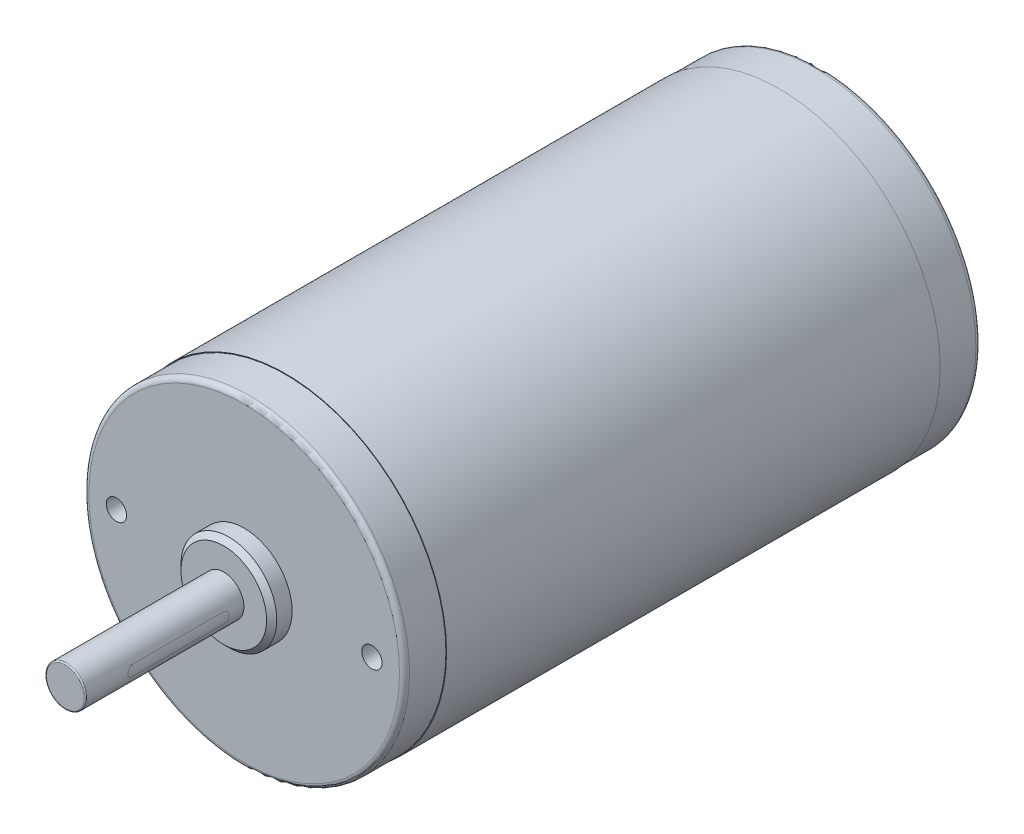
ISO-10303-21;
HEADER;
FILE_DESCRIPTION(('STEP AP214'),'2;1');
FILE_NAME('part.step','',(''),(''),'','','');
FILE_SCHEMA(('AUTOMOTIVE_DESIGN { 1 0 10303 214 1 1 1 1 }'));
ENDSEC;
DATA;
#1=APPLICATION_CONTEXT('core data for automotive mechanical design processes');
#2=APPLICATION_PROTOCOL_DEFINITION('international standard','automotive_design',2000,#1);
#3=PRODUCT_CONTEXT('',#1,'mechanical');
#4=PRODUCT('Part','Part','',(#3));
#5=PRODUCT_RELATED_PRODUCT_CATEGORY('part','',(#4));
#6=PRODUCT_DEFINITION_FORMATION('','',#4);
#7=PRODUCT_DEFINITION_CONTEXT('part definition',#1,'design');
#8=PRODUCT_DEFINITION('design','',#6,#7);
#9=PRODUCT_DEFINITION_SHAPE('','',#8);
#10=(LENGTH_UNIT() NAMED_UNIT(*) SI_UNIT(.MILLI.,.METRE.));
#11=(NAMED_UNIT(*) PLANE_ANGLE_UNIT() SI_UNIT($,.RADIAN.));
#12=(NAMED_UNIT(*) SI_UNIT($,.STERADIAN.) SOLID_ANGLE_UNIT());
#13=UNCERTAINTY_MEASURE_WITH_UNIT(LENGTH_MEASURE(1.E-05),#10,'distance_accuracy_value','');
#14=(GEOMETRIC_REPRESENTATION_CONTEXT(3) GLOBAL_UNCERTAINTY_ASSIGNED_CONTEXT((#13)) GLOBAL_UNIT_ASSIGNED_CONTEXT((#10,
#11,#12)) REPRESENTATION_CONTEXT('',''));
#15=CARTESIAN_POINT('',(0.,0.,0.));
#16=DIRECTION('',(0.,0.,1.));
#17=DIRECTION('',(1.,0.,0.));
#18=AXIS2_PLACEMENT_3D('',#15,#16,#17);
#19=CARTESIAN_POINT('',(35.56,109.2962,10.8204000000007));
#20=DIRECTION('',(0.,0.,-1.));
#21=DIRECTION('',(-1.,0.,0.));
#22=AXIS2_PLACEMENT_3D('',#19,#20,#21);
#23=CYLINDRICAL_SURFACE('',#22,32.0040000000005);
#24=CARTESIAN_POINT('',(35.56,109.2962,10.8204000000007));
#25=DIRECTION('',(0.,0.,-1.));
#26=DIRECTION('',(-1.,0.,0.));
#27=AXIS2_PLACEMENT_3D('',#24,#25,#26);
#28=CIRCLE('',#27,32.0040000000005);
#29=CARTESIAN_POINT('',(3.5559999999995,109.2962,10.8204000000007));
#30=VERTEX_POINT('',#29);
#31=EDGE_CURVE('P0_E177',#30,#30,#28,.T.);
#32=ORIENTED_EDGE('',*,*,#31,.T.);
#33=EDGE_LOOP('',(#32));
#34=FACE_BOUND('',#33,.T.);
#35=CARTESIAN_POINT('',(35.56,109.2962,-87.325199999998));
#36=DIRECTION('',(0.,0.,-1.));
#37=DIRECTION('',(-1.,0.,0.));
#38=AXIS2_PLACEMENT_3D('',#35,#36,#37);
#39=CIRCLE('',#38,32.0040000000005);
#40=CARTESIAN_POINT('',(3.5559999999995,109.2962,-87.325199999998));
#41=VERTEX_POINT('',#40);
#42=EDGE_CURVE('P0_E119',#41,#41,#39,.T.);
#43=ORIENTED_EDGE('',*,*,#42,.F.);
#44=EDGE_LOOP('',(#43));
#45=FACE_BOUND('',#44,.T.);
#46=ADVANCED_FACE('P0_F36',(#34,#45),#23,.T.);
#47=CARTESIAN_POINT('',(67.5640000000005,109.2962,10.8204000000007));
#48=DIRECTION('',(0.,0.,1.));
#49=DIRECTION('',(1.,0.,0.));
#50=AXIS2_PLACEMENT_3D('',#47,#48,#49);
#51=PLANE('',#50);
#52=CARTESIAN_POINT('',(35.56,109.2962,10.8204000000007));
#53=DIRECTION('',(0.,0.,1.));
#54=DIRECTION('',(1.,0.,0.));
#55=AXIS2_PLACEMENT_3D('',#52,#53,#54);
#56=CIRCLE('',#55,31.8770000000005);
#57=CARTESIAN_POINT('',(67.4370000000005,109.2962,10.8204000000007));
#58=VERTEX_POINT('',#57);
#59=EDGE_CURVE('P0_E168',#58,#58,#56,.T.);
#60=ORIENTED_EDGE('',*,*,#59,.F.);
#61=EDGE_LOOP('',(#60));
#62=FACE_BOUND('',#61,.T.);
#63=ORIENTED_EDGE('',*,*,#31,.F.);
#64=EDGE_LOOP('',(#63));
#65=FACE_BOUND('',#64,.T.);
#66=ADVANCED_FACE('P0_F225',(#62,#65),#51,.T.);
#67=CARTESIAN_POINT('',(35.56,109.2962,-87.325199999998));
#68=DIRECTION('',(0.,0.,-1.));
#69=DIRECTION('',(-1.,0.,0.));
#70=AXIS2_PLACEMENT_3D('',#67,#68,#69);
#71=PLANE('',#70);
#72=CARTESIAN_POINT('',(35.56,109.2962,-87.325199999998));
#73=DIRECTION('',(0.,0.,-1.));
#74=DIRECTION('',(-1.,0.,0.));
#75=AXIS2_PLACEMENT_3D('',#72,#73,#74);
#76=CIRCLE('',#75,31.8770000000005);
#77=CARTESIAN_POINT('',(3.68299999999951,109.2962,-87.325199999998));
#78=VERTEX_POINT('',#77);
#79=EDGE_CURVE('P0_E174',#78,#78,#76,.T.);
#80=ORIENTED_EDGE('',*,*,#79,.F.);
#81=EDGE_LOOP('',(#80));
#82=FACE_BOUND('',#81,.T.);
#83=ORIENTED_EDGE('',*,*,#42,.T.);
#84=EDGE_LOOP('',(#83));
#85=FACE_BOUND('',#84,.T.);
#86=ADVANCED_FACE('P0_F231',(#82,#85),#71,.T.);
#87=CARTESIAN_POINT('',(35.56,109.2962,-95.554799999998));
#88=DIRECTION('',(0.,0.,1.));
#89=DIRECTION('',(1.,0.,0.));
#90=AXIS2_PLACEMENT_3D('',#87,#88,#89);
#91=CYLINDRICAL_SURFACE('',#90,31.8770000000005);
#92=CARTESIAN_POINT('',(35.56,109.2962,-94.554799999998));
#93=DIRECTION('',(0.,0.,-1.));
#94=DIRECTION('',(-1.,0.,0.));
#95=AXIS2_PLACEMENT_3D('',#92,#93,#94);
#96=CIRCLE('',#95,31.8770000000005);
#97=CARTESIAN_POINT('',(3.68299999999951,109.2962,-94.554799999998));
#98=VERTEX_POINT('',#97);
#99=EDGE_CURVE('P0_E208',#98,#98,#96,.F.);
#100=ORIENTED_EDGE('',*,*,#99,.T.);
#101=EDGE_LOOP('',(#100));
#102=FACE_BOUND('',#101,.T.);
#103=ORIENTED_EDGE('',*,*,#79,.T.);
#104=EDGE_LOOP('',(#103));
#105=FACE_BOUND('',#104,.T.);
#106=ADVANCED_FACE('P0_F289',(#102,#105),#91,.T.);
#107=CARTESIAN_POINT('',(35.56,109.2962,-95.554799999998));
#108=DIRECTION('',(0.,0.,-1.));
#109=DIRECTION('',(-1.,0.,0.));
#110=AXIS2_PLACEMENT_3D('',#107,#108,#109);
#111=PLANE('',#110);
#112=CARTESIAN_POINT('',(35.56,109.2962,-95.554799999998));
#113=DIRECTION('',(0.,0.,-1.));
#114=DIRECTION('',(-1.,0.,0.));
#115=AXIS2_PLACEMENT_3D('',#112,#113,#114);
#116=CIRCLE('',#115,30.8770000000005);
#117=CARTESIAN_POINT('',(4.6829999999995,109.2962,-95.554799999998));
#118=VERTEX_POINT('',#117);
#119=EDGE_CURVE('P0_E205',#118,#118,#116,.T.);
#120=ORIENTED_EDGE('',*,*,#119,.T.);
#121=EDGE_LOOP('',(#120));
#122=FACE_BOUND('',#121,.T.);
#123=CARTESIAN_POINT('',(46.76735963712,127.903290682857,-95.554799999998));
#124=DIRECTION('',(0.,0.,-1.));
#125=DIRECTION('',(-1.,0.,0.));
#126=AXIS2_PLACEMENT_3D('',#123,#124,#125);
#127=CIRCLE('',#126,4.31800000197918);
#128=CARTESIAN_POINT('',(42.4493596351408,127.903290682857,-95.554799999998));
#129=VERTEX_POINT('',#128);
#130=EDGE_CURVE('P0_E184',#129,#129,#127,.T.);
#131=ORIENTED_EDGE('',*,*,#130,.F.);
#132=EDGE_LOOP('',(#131));
#133=FACE_BOUND('',#132,.T.);
#134=CARTESIAN_POINT('',(54.1670906808811,120.503559639095,-95.554799999998));
#135=DIRECTION('',(0.,0.,-1.));
#136=DIRECTION('',(-1.,0.,0.));
#137=AXIS2_PLACEMENT_3D('',#134,#135,#136);
#138=CIRCLE('',#137,4.3180000019652);
#139=CARTESIAN_POINT('',(49.8490906789159,120.503559639095,-95.554799999998));
#140=VERTEX_POINT('',#139);
#141=EDGE_CURVE('P0_E164',#140,#140,#138,.T.);
#142=ORIENTED_EDGE('',*,*,#141,.F.);
#143=EDGE_LOOP('',(#142));
#144=FACE_BOUND('',#143,.T.);
#145=CARTESIAN_POINT('',(35.56,109.2962,-95.554799999998));
#146=DIRECTION('',(0.,0.,-1.));
#147=DIRECTION('',(-1.,0.,0.));
#148=AXIS2_PLACEMENT_3D('',#145,#146,#147);
#149=CIRCLE('',#148,15.0368000000003);
#150=CARTESIAN_POINT('',(20.5231999999997,109.2962,-95.554799999998));
#151=VERTEX_POINT('',#150);
#152=EDGE_CURVE('P0_E171',#151,#151,#149,.T.);
#153=ORIENTED_EDGE('',*,*,#152,.F.);
#154=EDGE_LOOP('',(#153));
#155=FACE_BOUND('',#154,.T.);
#156=ADVANCED_FACE('P0_F285',(#122,#133,#144,#155),#111,.T.);
#157=CARTESIAN_POINT('',(35.56,109.2962,-100.317299999998));
#158=DIRECTION('',(0.,0.,1.));
#159=DIRECTION('',(1.,0.,0.));
#160=AXIS2_PLACEMENT_3D('',#157,#158,#159);
#161=CYLINDRICAL_SURFACE('',#160,15.0368000000003);
#162=CARTESIAN_POINT('',(35.56,109.2962,-99.317299999998));
#163=DIRECTION('',(0.,0.,-1.));
#164=DIRECTION('',(-1.,0.,0.));
#165=AXIS2_PLACEMENT_3D('',#162,#163,#164);
#166=CIRCLE('',#165,15.0368000000003);
#167=CARTESIAN_POINT('',(20.5231999999997,109.2962,-99.317299999998));
#168=VERTEX_POINT('',#167);
#169=EDGE_CURVE('P0_E11',#168,#168,#166,.F.);
#170=ORIENTED_EDGE('',*,*,#169,.T.);
#171=EDGE_LOOP('',(#170));
#172=FACE_BOUND('',#171,.T.);
#173=ORIENTED_EDGE('',*,*,#152,.T.);
#174=EDGE_LOOP('',(#173));
#175=FACE_BOUND('',#174,.T.);
#176=ADVANCED_FACE('P0_F282',(#172,#175),#161,.T.);
#177=CARTESIAN_POINT('',(35.56,109.2962,-100.317299999998));
#178=DIRECTION('',(0.,0.,-1.));
#179=DIRECTION('',(-1.,0.,0.));
#180=AXIS2_PLACEMENT_3D('',#177,#178,#179);
#181=PLANE('',#180);
#182=CARTESIAN_POINT('',(35.56,109.2962,-100.317299999998));
#183=DIRECTION('',(0.,0.,-1.));
#184=DIRECTION('',(-1.,0.,0.));
#185=AXIS2_PLACEMENT_3D('',#182,#183,#184);
#186=CIRCLE('',#185,14.0368000000003);
#187=CARTESIAN_POINT('',(21.5231999999997,109.2962,-100.317299999998));
#188=VERTEX_POINT('',#187);
#189=EDGE_CURVE('P0_E44',#188,#188,#186,.T.);
#190=ORIENTED_EDGE('',*,*,#189,.T.);
#191=EDGE_LOOP('',(#190));
#192=FACE_BOUND('',#191,.T.);
#193=ADVANCED_FACE('P0_F213',(#192),#181,.T.);
#194=CARTESIAN_POINT('',(35.56,109.2962,19.05));
#195=DIRECTION('',(0.,0.,-1.));
#196=DIRECTION('',(-1.,0.,0.));
#197=AXIS2_PLACEMENT_3D('',#194,#195,#196);
#198=CYLINDRICAL_SURFACE('',#197,31.8770000000005);
#199=CARTESIAN_POINT('',(35.56,109.2962,18.05));
#200=DIRECTION('',(0.,0.,1.));
#201=DIRECTION('',(1.,0.,0.));
#202=AXIS2_PLACEMENT_3D('',#199,#200,#201);
#203=CIRCLE('',#202,31.8770000000005);
#204=CARTESIAN_POINT('',(67.4370000000005,109.2962,18.05));
#205=VERTEX_POINT('',#204);
#206=EDGE_CURVE('P0_E202',#205,#205,#203,.F.);
#207=ORIENTED_EDGE('',*,*,#206,.T.);
#208=EDGE_LOOP('',(#207));
#209=FACE_BOUND('',#208,.T.);
#210=ORIENTED_EDGE('',*,*,#59,.T.);
#211=EDGE_LOOP('',(#210));
#212=FACE_BOUND('',#211,.T.);
#213=ADVANCED_FACE('P0_F257',(#209,#212),#198,.T.);
#214=CARTESIAN_POINT('',(35.56,109.2962,19.05));
#215=DIRECTION('',(0.,0.,1.));
#216=DIRECTION('',(1.,0.,0.));
#217=AXIS2_PLACEMENT_3D('',#214,#215,#216);
#218=PLANE('',#217);
#219=CARTESIAN_POINT('',(35.56,109.2962,19.05));
#220=DIRECTION('',(0.,0.,1.));
#221=DIRECTION('',(1.,0.,0.));
#222=AXIS2_PLACEMENT_3D('',#219,#220,#221);
#223=CIRCLE('',#222,30.8770000000005);
#224=CARTESIAN_POINT('',(66.4370000000005,109.2962,19.05));
#225=VERTEX_POINT('',#224);
#226=EDGE_CURVE('P0_E199',#225,#225,#223,.T.);
#227=ORIENTED_EDGE('',*,*,#226,.T.);
#228=EDGE_LOOP('',(#227));
#229=FACE_BOUND('',#228,.T.);
#230=CARTESIAN_POINT('',(10.1599999999994,109.2962,19.05));
#231=DIRECTION('',(0.,0.,1.));
#232=DIRECTION('',(1.,0.,0.));
#233=AXIS2_PLACEMENT_3D('',#230,#231,#232);
#234=CIRCLE('',#233,2.01930000000002);
#235=CARTESIAN_POINT('',(12.1792999999994,109.2962,19.05));
#236=VERTEX_POINT('',#235);
#237=EDGE_CURVE('P0_E93',#236,#236,#234,.T.);
#238=ORIENTED_EDGE('',*,*,#237,.F.);
#239=EDGE_LOOP('',(#238));
#240=FACE_BOUND('',#239,.T.);
#241=CARTESIAN_POINT('',(60.96,109.2962,19.05));
#242=DIRECTION('',(0.,0.,1.));
#243=DIRECTION('',(1.,0.,0.));
#244=AXIS2_PLACEMENT_3D('',#241,#242,#243);
#245=CIRCLE('',#244,2.01930000000002);
#246=CARTESIAN_POINT('',(62.9793,109.2962,19.05));
#247=VERTEX_POINT('',#246);
#248=EDGE_CURVE('P0_E92',#247,#247,#245,.T.);
#249=ORIENTED_EDGE('',*,*,#248,.F.);
#250=EDGE_LOOP('',(#249));
#251=FACE_BOUND('',#250,.T.);
#252=CARTESIAN_POINT('',(35.56,109.2962,19.05));
#253=DIRECTION('',(0.,0.,1.));
#254=DIRECTION('',(1.,0.,0.));
#255=AXIS2_PLACEMENT_3D('',#252,#253,#254);
#256=CIRCLE('',#255,9.52500000000019);
#257=CARTESIAN_POINT('',(45.0850000000002,109.2962,19.05));
#258=VERTEX_POINT('',#257);
#259=EDGE_CURVE('P0_E165',#258,#258,#256,.T.);
#260=ORIENTED_EDGE('',*,*,#259,.F.);
#261=EDGE_LOOP('',(#260));
#262=FACE_BOUND('',#261,.T.);
#263=ADVANCED_FACE('P0_F253',(#229,#240,#251,#262),#218,.T.);
#264=CARTESIAN_POINT('',(35.56,109.2962,23.114));
#265=DIRECTION('',(0.,0.,-1.));
#266=DIRECTION('',(-1.,0.,0.));
#267=AXIS2_PLACEMENT_3D('',#264,#265,#266);
#268=CYLINDRICAL_SURFACE('',#267,9.52500000000019);
#269=CARTESIAN_POINT('',(35.56,109.2962,22.0980000018232));
#270=DIRECTION('',(0.,0.,1.));
#271=DIRECTION('',(1.,0.,0.));
#272=AXIS2_PLACEMENT_3D('',#269,#270,#271);
#273=CIRCLE('',#272,9.52500000000019);
#274=CARTESIAN_POINT('',(45.0850000000002,109.2962,22.0980000018232));
#275=VERTEX_POINT('',#274);
#276=EDGE_CURVE('P0_E190',#275,#275,#273,.F.);
#277=ORIENTED_EDGE('',*,*,#276,.T.);
#278=EDGE_LOOP('',(#277));
#279=FACE_BOUND('',#278,.T.);
#280=ORIENTED_EDGE('',*,*,#259,.T.);
#281=EDGE_LOOP('',(#280));
#282=FACE_BOUND('',#281,.T.);
#283=ADVANCED_FACE('P0_F256',(#279,#282),#268,.T.);
#284=CARTESIAN_POINT('',(35.56,109.2962,23.114));
#285=DIRECTION('',(0.,0.,1.));
#286=DIRECTION('',(1.,0.,0.));
#287=AXIS2_PLACEMENT_3D('',#284,#285,#286);
#288=PLANE('',#287);
#289=CARTESIAN_POINT('',(35.56,109.2962,23.114));
#290=DIRECTION('',(0.,0.,1.));
#291=DIRECTION('',(1.,0.,0.));
#292=AXIS2_PLACEMENT_3D('',#289,#290,#291);
#293=CIRCLE('',#292,8.50899999999979);
#294=CARTESIAN_POINT('',(44.0689999999998,109.2962,23.114));
#295=VERTEX_POINT('',#294);
#296=EDGE_CURVE('P0_E187',#295,#295,#293,.T.);
#297=ORIENTED_EDGE('',*,*,#296,.T.);
#298=EDGE_LOOP('',(#297));
#299=FACE_BOUND('',#298,.T.);
#300=CARTESIAN_POINT('',(35.56,109.2962,23.114));
#301=DIRECTION('',(0.,0.,1.));
#302=DIRECTION('',(1.,0.,0.));
#303=AXIS2_PLACEMENT_3D('',#300,#301,#302);
#304=CIRCLE('',#303,4.00000000000007);
#305=CARTESIAN_POINT('',(39.5600000000001,109.2962,23.114));
#306=VERTEX_POINT('',#305);
#307=EDGE_CURVE('P0_E161',#306,#306,#304,.T.);
#308=ORIENTED_EDGE('',*,*,#307,.F.);
#309=EDGE_LOOP('',(#308));
#310=FACE_BOUND('',#309,.T.);
#311=ADVANCED_FACE('P0_F266',(#299,#310),#288,.T.);
#312=CARTESIAN_POINT('',(35.56,109.2962,54.614));
#313=DIRECTION('',(0.,0.,-1.));
#314=DIRECTION('',(-1.,0.,0.));
#315=AXIS2_PLACEMENT_3D('',#312,#313,#314);
#316=CYLINDRICAL_SURFACE('',#315,4.00000000000007);
#317=CARTESIAN_POINT('',(35.56,109.2962,54.36));
#318=DIRECTION('',(0.,0.,1.));
#319=DIRECTION('',(1.,0.,0.));
#320=AXIS2_PLACEMENT_3D('',#317,#318,#319);
#321=CIRCLE('',#320,4.00000000000007);
#322=CARTESIAN_POINT('',(39.5600000000001,109.2962,54.36));
#323=VERTEX_POINT('',#322);
#324=EDGE_CURVE('P0_E196',#323,#323,#321,.F.);
#325=ORIENTED_EDGE('',*,*,#324,.T.);
#326=EDGE_LOOP('',(#325));
#327=FACE_BOUND('',#326,.T.);
#328=DIRECTION('',(0.,0.,-1.));
#329=VECTOR('',#328,1.);
#330=CARTESIAN_POINT('',(39.4197279696891,110.3462,54.614));
#331=LINE('',#330,#329);
#332=CARTESIAN_POINT('',(39.4197279696891,110.3462,45.1));
#333=VERTEX_POINT('',#332);
#334=CARTESIAN_POINT('',(39.4197279696891,110.3462,27.1));
#335=VERTEX_POINT('',#334);
#336=EDGE_CURVE('P0_E129',#333,#335,#331,.T.);
#337=ORIENTED_EDGE('',*,*,#336,.T.);
#338=CARTESIAN_POINT('',(39.4197279696891,110.3462,27.1));
#339=CARTESIAN_POINT('',(39.4197258950768,110.34620041025,27.0710051009623));
#340=CARTESIAN_POINT('',(39.4200551064329,110.344998227256,27.0420246228058));
#341=CARTESIAN_POINT('',(39.4213547123988,110.340206209835,26.9842814282389));
#342=CARTESIAN_POINT('',(39.4223249908093,110.336616808112,26.9555186733196));
#343=CARTESIAN_POINT('',(39.4261578920524,110.322321932764,26.8699951160553));
#344=CARTESIAN_POINT('',(39.4299428342912,110.308089542303,26.8138236492985));
#345=CARTESIAN_POINT('',(39.4395286889104,110.270686835054,26.7047742036821));
#346=CARTESIAN_POINT('',(39.445329326456,110.247517736714,26.6518957769836));
#347=CARTESIAN_POINT('',(39.4582892232805,110.192930496084,26.5507488556207));
#348=CARTESIAN_POINT('',(39.4654488628844,110.161510043656,26.5024816571346));
#349=CARTESIAN_POINT('',(39.4805119710478,110.090509636998,26.4107922298844));
#350=CARTESIAN_POINT('',(39.4884281885094,110.050767743087,26.3674975328551));
#351=CARTESIAN_POINT('',(39.5040047400555,109.964586854037,26.2880931254825));
#352=CARTESIAN_POINT('',(39.5116649818293,109.91814547434,26.2519859843525));
#353=CARTESIAN_POINT('',(39.526010604883,109.818987620195,26.1874496103786));
#354=CARTESIAN_POINT('',(39.5326785635433,109.766183168704,26.159151481312));
#355=CARTESIAN_POINT('',(39.5441298010583,109.656397945762,26.1119111599868));
#356=CARTESIAN_POINT('',(39.5489153447307,109.599422291421,26.0929577177131));
#357=CARTESIAN_POINT('',(39.5549473168842,109.501171577289,26.0693758272655));
#358=CARTESIAN_POINT('',(39.5568321627736,109.46054623456,26.0621227253234));
#359=CARTESIAN_POINT('',(39.5593590428507,109.378686103609,26.052433965248));
#360=CARTESIAN_POINT('',(39.560001100914,109.337451327111,26.0499982145665));
#361=CARTESIAN_POINT('',(39.5599984549201,109.238305738357,26.0500025057704));
#362=CARTESIAN_POINT('',(39.5587300938834,109.18037887734,26.0548061723029));
#363=CARTESIAN_POINT('',(39.5537908073877,109.066174828257,26.0738680806171));
#364=CARTESIAN_POINT('',(39.5501176251492,109.009899241695,26.0881352034471));
#365=CARTESIAN_POINT('',(39.5407752151886,108.900688958064,26.1256289904428));
#366=CARTESIAN_POINT('',(39.5351088856793,108.847749541003,26.148842650214));
#367=CARTESIAN_POINT('',(39.5223803452478,108.746519851806,26.2035277086069));
#368=CARTESIAN_POINT('',(39.5153181479083,108.698229534436,26.2349990268771));
#369=CARTESIAN_POINT('',(39.5003832391547,108.606575585264,26.3060552920619));
#370=CARTESIAN_POINT('',(39.4924970081334,108.563331555532,26.3457916691671));
#371=CARTESIAN_POINT('',(39.4768899553604,108.484036309153,26.431929982209));
#372=CARTESIAN_POINT('',(39.4691691622905,108.447986330864,26.4783330633665));
#373=CARTESIAN_POINT('',(39.4546281048764,108.383519395399,26.5774412854526));
#374=CARTESIAN_POINT('',(39.447825217303,108.355241372008,26.6302394851058));
#375=CARTESIAN_POINT('',(39.4360941322255,108.308025058775,26.7400354515098));
#376=CARTESIAN_POINT('',(39.4311644713835,108.289079475123,26.7970298984879));
#377=CARTESIAN_POINT('',(39.424947536189,108.265530062073,26.8952701656664));
#378=CARTESIAN_POINT('',(39.4230031721686,108.258293447667,26.9358624533813));
#379=CARTESIAN_POINT('',(39.4203876966156,108.248624950633,27.0176289590907));
#380=CARTESIAN_POINT('',(39.419715789786,108.246190066839,27.058802797386));
#381=CARTESIAN_POINT('',(39.4197279696891,108.2462,27.1));
#382=B_SPLINE_CURVE_WITH_KNOTS('',3,(#338,#339,#340,#341,#342,#343,#344,#345,#346,#347,#348,
#349,#350,#351,#352,#353,#354,#355,#356,#357,#358,#359,#360,#361,#362,#363,#364,#365,#366,#367,
#368,#369,#370,#371,#372,#373,#374,#375,#376,#377,#378,#379,#380,#381),.UNSPECIFIED.,.F.,.F.,(4,
2,2,2,2,2,2,2,2,2,2,2,2,2,2,2,2,2,2,2,2,4),(0.,0.0869295778834455,0.173843403286115,
0.347151826879623,0.520436629596136,0.693769998810197,0.870856390838592,1.0480059697082,
1.22797015523124,1.40771715061754,1.53136439682191,1.65500926755904,1.82853892099358,
2.00223165541559,2.17567286221396,2.34911238140168,2.52606492372391,2.7030478997598,
2.88301467869372,3.06284057971519,3.18638852057381,3.30985921734618),.UNSPECIFIED.);
#383=CARTESIAN_POINT('',(39.4197279696891,108.2462,27.1));
#384=VERTEX_POINT('',#383);
#385=EDGE_CURVE('P0_E115',#335,#384,#382,.T.);
#386=ORIENTED_EDGE('',*,*,#385,.T.);
#387=DIRECTION('',(0.,0.,-1.));
#388=VECTOR('',#387,1.);
#389=CARTESIAN_POINT('',(39.4197279696891,108.2462,54.614));
#390=LINE('',#389,#388);
#391=CARTESIAN_POINT('',(39.4197279696891,108.2462,45.1));
#392=VERTEX_POINT('',#391);
#393=EDGE_CURVE('P0_E142',#384,#392,#390,.F.);
#394=ORIENTED_EDGE('',*,*,#393,.T.);
#395=CARTESIAN_POINT('',(39.4197279696891,108.2462,45.1));
#396=CARTESIAN_POINT('',(39.4197258950768,108.24619958975,45.1289948990377));
#397=CARTESIAN_POINT('',(39.4200551064328,108.247401772744,45.1579753771942));
#398=CARTESIAN_POINT('',(39.4213547123988,108.252193790165,45.2157185717611));
#399=CARTESIAN_POINT('',(39.4223249908093,108.255783191888,45.2444813266804));
#400=CARTESIAN_POINT('',(39.4261578920524,108.270078067236,45.3300048839447));
#401=CARTESIAN_POINT('',(39.4299428342912,108.284310457697,45.3861763507014));
#402=CARTESIAN_POINT('',(39.4395286889104,108.321713164946,45.4952257963179));
#403=CARTESIAN_POINT('',(39.445329326456,108.344882263286,45.5481042230163));
#404=CARTESIAN_POINT('',(39.4582892232805,108.399469503916,45.6492511443793));
#405=CARTESIAN_POINT('',(39.4654488628844,108.430889956344,45.6975183428654));
#406=CARTESIAN_POINT('',(39.4805119710478,108.501890363002,45.7892077701155));
#407=CARTESIAN_POINT('',(39.4884281885094,108.541632256913,45.8325024671448));
#408=CARTESIAN_POINT('',(39.5040047400555,108.627813145963,45.9119068745175));
#409=CARTESIAN_POINT('',(39.5116649818293,108.67425452566,45.9480140156475));
#410=CARTESIAN_POINT('',(39.526010604883,108.773412379805,46.0125503896214));
#411=CARTESIAN_POINT('',(39.5326785635433,108.826216831296,46.040848518688));
#412=CARTESIAN_POINT('',(39.5441298010583,108.936002054238,46.0880888400132));
#413=CARTESIAN_POINT('',(39.5489153447307,108.992977708579,46.1070422822868));
#414=CARTESIAN_POINT('',(39.5549473168842,109.091228422711,46.1306241727345));
#415=CARTESIAN_POINT('',(39.5568321627736,109.13185376544,46.1378772746766));
#416=CARTESIAN_POINT('',(39.5593590428507,109.213713896391,46.147566034752));
#417=CARTESIAN_POINT('',(39.560001100914,109.254948672889,46.1500017854335));
#418=CARTESIAN_POINT('',(39.5599984549201,109.354094261643,46.1499974942296));
#419=CARTESIAN_POINT('',(39.5587300938834,109.412021122661,46.1451938276971));
#420=CARTESIAN_POINT('',(39.5537908073877,109.526225171743,46.1261319193829));
#421=CARTESIAN_POINT('',(39.5501176251492,109.582500758305,46.1118647965529));
#422=CARTESIAN_POINT('',(39.5407752151886,109.691711041936,46.0743710095572));
#423=CARTESIAN_POINT('',(39.5351088856793,109.744650458997,46.051157349786));
#424=CARTESIAN_POINT('',(39.5223803452478,109.845880148194,45.9964722913931));
#425=CARTESIAN_POINT('',(39.5153181479083,109.894170465564,45.9650009731229));
#426=CARTESIAN_POINT('',(39.5003832391547,109.985824414736,45.8939447079381));
#427=CARTESIAN_POINT('',(39.4924970081334,110.029068444468,45.8542083308329));
#428=CARTESIAN_POINT('',(39.4768899553604,110.108363690847,45.768070017791));
#429=CARTESIAN_POINT('',(39.4691691622905,110.144413669136,45.7216669366335));
#430=CARTESIAN_POINT('',(39.4546281048764,110.208880604601,45.6225587145474));
#431=CARTESIAN_POINT('',(39.447825217303,110.237158627992,45.5697605148942));
#432=CARTESIAN_POINT('',(39.4360941322255,110.284374941225,45.4599645484902));
#433=CARTESIAN_POINT('',(39.4311644713835,110.303320524877,45.4029701015121));
#434=CARTESIAN_POINT('',(39.424947536189,110.326869937927,45.3047298343336));
#435=CARTESIAN_POINT('',(39.4230031721686,110.334106552333,45.2641375466187));
#436=CARTESIAN_POINT('',(39.4203876966156,110.343775049367,45.1823710409093));
#437=CARTESIAN_POINT('',(39.419715789786,110.346209933161,45.141197202614));
#438=CARTESIAN_POINT('',(39.4197279696891,110.3462,45.1));
#439=B_SPLINE_CURVE_WITH_KNOTS('',3,(#395,#396,#397,#398,#399,#400,#401,#402,#403,#404,#405,
#406,#407,#408,#409,#410,#411,#412,#413,#414,#415,#416,#417,#418,#419,#420,#421,#422,#423,#424,
#425,#426,#427,#428,#429,#430,#431,#432,#433,#434,#435,#436,#437,#438),.UNSPECIFIED.,.F.,.F.,(4,
2,2,2,2,2,2,2,2,2,2,2,2,2,2,2,2,2,2,2,2,4),(0.,0.0869295778834422,0.17384340328612,
0.347151826879625,0.520436629596116,0.69376999881019,0.870856390838584,1.04800596970821,
1.22797015523126,1.40771715061754,1.53136439682193,1.65500926755904,1.82853892099362,
2.0022316554156,2.17567286221397,2.34911238140169,2.52606492372393,2.70304789975981,
2.88301467869373,3.0628405797152,3.18638852057382,3.3098592173462),.UNSPECIFIED.);
#440=EDGE_CURVE('P0_E51',#392,#333,#439,.T.);
#441=ORIENTED_EDGE('',*,*,#440,.T.);
#442=EDGE_LOOP('',(#337,#386,#394,#441));
#443=FACE_BOUND('',#442,.T.);
#444=ORIENTED_EDGE('',*,*,#307,.T.);
#445=EDGE_LOOP('',(#444));
#446=FACE_BOUND('',#445,.T.);
#447=ADVANCED_FACE('P0_F272',(#327,#443,#446),#316,.T.);
#448=CARTESIAN_POINT('',(35.56,109.2962,54.614));
#449=DIRECTION('',(0.,0.,1.));
#450=DIRECTION('',(1.,0.,0.));
#451=AXIS2_PLACEMENT_3D('',#448,#449,#450);
#452=PLANE('',#451);
#453=CARTESIAN_POINT('',(35.56,109.2962,54.614));
#454=DIRECTION('',(0.,0.,1.));
#455=DIRECTION('',(1.,0.,0.));
#456=AXIS2_PLACEMENT_3D('',#453,#454,#455);
#457=CIRCLE('',#456,3.74600000000007);
#458=CARTESIAN_POINT('',(39.3060000000001,109.2962,54.614));
#459=VERTEX_POINT('',#458);
#460=EDGE_CURVE('P0_E193',#459,#459,#457,.T.);
#461=ORIENTED_EDGE('',*,*,#460,.T.);
#462=EDGE_LOOP('',(#461));
#463=FACE_BOUND('',#462,.T.);
#464=ADVANCED_FACE('P0_F482',(#463),#452,.T.);
#465=CARTESIAN_POINT('',(67.5650000000005,109.2962,27.1));
#466=DIRECTION('',(-1.,0.,0.));
#467=DIRECTION('',(0.,0.,1.));
#468=AXIS2_PLACEMENT_3D('',#465,#466,#467);
#469=CYLINDRICAL_SURFACE('',#468,1.05);
#470=ORIENTED_EDGE('',*,*,#385,.F.);
#471=DIRECTION('',(-1.,0.,0.));
#472=VECTOR('',#471,1.);
#473=CARTESIAN_POINT('',(67.5650000000005,110.3462,27.1));
#474=LINE('',#473,#472);
#475=CARTESIAN_POINT('',(38.3600000000001,110.3462,27.1));
#476=VERTEX_POINT('',#475);
#477=EDGE_CURVE('P0_E133',#335,#476,#474,.T.);
#478=ORIENTED_EDGE('',*,*,#477,.T.);
#479=CARTESIAN_POINT('',(38.3600000000001,109.2962,27.1));
#480=DIRECTION('',(-1.,0.,0.));
#481=DIRECTION('',(0.,0.,1.));
#482=AXIS2_PLACEMENT_3D('',#479,#480,#481);
#483=CIRCLE('',#482,1.05);
#484=CARTESIAN_POINT('',(38.3600000000001,108.2462,27.1));
#485=VERTEX_POINT('',#484);
#486=EDGE_CURVE('P0_E126',#476,#485,#483,.T.);
#487=ORIENTED_EDGE('',*,*,#486,.T.);
#488=DIRECTION('',(-1.,0.,0.));
#489=VECTOR('',#488,1.);
#490=CARTESIAN_POINT('',(67.5650000000005,108.2462,27.1));
#491=LINE('',#490,#489);
#492=EDGE_CURVE('P0_E59',#384,#485,#491,.T.);
#493=ORIENTED_EDGE('',*,*,#492,.F.);
#494=EDGE_LOOP('',(#470,#478,#487,#493));
#495=FACE_BOUND('',#494,.T.);
#496=ADVANCED_FACE('P0_F473',(#495),#469,.F.);
#497=CARTESIAN_POINT('',(67.5650000000005,110.3462,45.1));
#498=DIRECTION('',(0.,1.,0.));
#499=DIRECTION('',(0.,0.,1.));
#500=AXIS2_PLACEMENT_3D('',#497,#498,#499);
#501=PLANE('',#500);
#502=ORIENTED_EDGE('',*,*,#336,.F.);
#503=DIRECTION('',(-1.,0.,0.));
#504=VECTOR('',#503,1.);
#505=CARTESIAN_POINT('',(67.5650000000005,110.3462,45.1));
#506=LINE('',#505,#504);
#507=CARTESIAN_POINT('',(38.3600000000001,110.3462,45.1));
#508=VERTEX_POINT('',#507);
#509=EDGE_CURVE('P0_E156',#333,#508,#506,.T.);
#510=ORIENTED_EDGE('',*,*,#509,.T.);
#511=DIRECTION('',(0.,0.,-1.));
#512=VECTOR('',#511,1.);
#513=CARTESIAN_POINT('',(38.3600000000001,110.3462,45.1));
#514=LINE('',#513,#512);
#515=EDGE_CURVE('P0_E116',#508,#476,#514,.T.);
#516=ORIENTED_EDGE('',*,*,#515,.T.);
#517=ORIENTED_EDGE('',*,*,#477,.F.);
#518=EDGE_LOOP('',(#502,#510,#516,#517));
#519=FACE_BOUND('',#518,.T.);
#520=ADVANCED_FACE('P0_F465',(#519),#501,.F.);
#521=CARTESIAN_POINT('',(67.5650000000005,109.2962,45.1));
#522=DIRECTION('',(-1.,0.,0.));
#523=DIRECTION('',(0.,0.,1.));
#524=AXIS2_PLACEMENT_3D('',#521,#522,#523);
#525=CYLINDRICAL_SURFACE('',#524,1.05);
#526=ORIENTED_EDGE('',*,*,#440,.F.);
#527=DIRECTION('',(-1.,0.,0.));
#528=VECTOR('',#527,1.);
#529=CARTESIAN_POINT('',(67.5650000000005,108.2462,45.1));
#530=LINE('',#529,#528);
#531=CARTESIAN_POINT('',(38.3600000000001,108.2462,45.1));
#532=VERTEX_POINT('',#531);
#533=EDGE_CURVE('P0_E128',#392,#532,#530,.T.);
#534=ORIENTED_EDGE('',*,*,#533,.T.);
#535=CARTESIAN_POINT('',(38.3600000000001,109.2962,45.1));
#536=DIRECTION('',(-1.,0.,0.));
#537=DIRECTION('',(0.,0.,1.));
#538=AXIS2_PLACEMENT_3D('',#535,#536,#537);
#539=CIRCLE('',#538,1.05);
#540=EDGE_CURVE('P0_E120',#532,#508,#539,.T.);
#541=ORIENTED_EDGE('',*,*,#540,.T.);
#542=ORIENTED_EDGE('',*,*,#509,.F.);
#543=EDGE_LOOP('',(#526,#534,#541,#542));
#544=FACE_BOUND('',#543,.T.);
#545=ADVANCED_FACE('P0_F457',(#544),#525,.F.);
#546=CARTESIAN_POINT('',(67.5650000000005,108.2462,27.1));
#547=DIRECTION('',(0.,-1.,0.));
#548=DIRECTION('',(0.,0.,-1.));
#549=AXIS2_PLACEMENT_3D('',#546,#547,#548);
#550=PLANE('',#549);
#551=ORIENTED_EDGE('',*,*,#393,.F.);
#552=ORIENTED_EDGE('',*,*,#492,.T.);
#553=DIRECTION('',(0.,0.,1.));
#554=VECTOR('',#553,1.);
#555=CARTESIAN_POINT('',(38.3600000000001,108.2462,27.1));
#556=LINE('',#555,#554);
#557=EDGE_CURVE('P0_E123',#485,#532,#556,.T.);
#558=ORIENTED_EDGE('',*,*,#557,.T.);
#559=ORIENTED_EDGE('',*,*,#533,.F.);
#560=EDGE_LOOP('',(#551,#552,#558,#559));
#561=FACE_BOUND('',#560,.T.);
#562=ADVANCED_FACE('P0_F449',(#561),#550,.F.);
#563=CARTESIAN_POINT('',(38.3600000000001,109.2962,27.1));
#564=DIRECTION('',(-1.,0.,0.));
#565=DIRECTION('',(0.,0.,1.));
#566=AXIS2_PLACEMENT_3D('',#563,#564,#565);
#567=PLANE('',#566);
#568=ORIENTED_EDGE('',*,*,#486,.F.);
#569=ORIENTED_EDGE('',*,*,#515,.F.);
#570=ORIENTED_EDGE('',*,*,#540,.F.);
#571=ORIENTED_EDGE('',*,*,#557,.F.);
#572=EDGE_LOOP('',(#568,#569,#570,#571));
#573=FACE_BOUND('',#572,.T.);
#574=ADVANCED_FACE('P0_F440',(#573),#567,.F.);
#575=CARTESIAN_POINT('',(54.1670906808811,120.503559639095,-95.554799999998));
#576=DIRECTION('',(0.,0.,-1.));
#577=DIRECTION('',(-1.,0.,0.));
#578=AXIS2_PLACEMENT_3D('',#575,#576,#577);
#579=CYLINDRICAL_SURFACE('',#578,4.3180000019652);
#580=ORIENTED_EDGE('',*,*,#141,.T.);
#581=EDGE_LOOP('',(#580));
#582=FACE_BOUND('',#581,.T.);
#583=CARTESIAN_POINT('',(54.1670906808811,120.503559639095,-95.6026999960083));
#584=DIRECTION('',(0.,0.,-1.));
#585=DIRECTION('',(-1.,0.,0.));
#586=AXIS2_PLACEMENT_3D('',#583,#584,#585);
#587=CIRCLE('',#586,4.3180000019652);
#588=CARTESIAN_POINT('',(49.8490906789159,120.503559639095,-95.6026999960083));
#589=VERTEX_POINT('',#588);
#590=EDGE_CURVE('P0_E109',#589,#589,#587,.T.);
#591=ORIENTED_EDGE('',*,*,#590,.F.);
#592=EDGE_LOOP('',(#591));
#593=FACE_BOUND('',#592,.T.);
#594=ADVANCED_FACE('P0_F431',(#582,#593),#579,.T.);
#595=CARTESIAN_POINT('',(54.1670906808811,120.503559639095,-97.8026999980238));
#596=DIRECTION('',(0.,0.,-1.));
#597=DIRECTION('',(-1.,0.,0.));
#598=AXIS2_PLACEMENT_3D('',#595,#596,#597);
#599=PLANE('',#598);
#600=CARTESIAN_POINT('',(54.1670906808811,120.503559639095,-97.8026999980238));
#601=DIRECTION('',(0.,0.,-1.));
#602=DIRECTION('',(-1.,0.,0.));
#603=AXIS2_PLACEMENT_3D('',#600,#601,#602);
#604=CIRCLE('',#603,2.11799999994966);
#605=CARTESIAN_POINT('',(52.0490906809314,120.503559639095,-97.8026999980238));
#606=VERTEX_POINT('',#605);
#607=EDGE_CURVE('P0_E112',#606,#606,#604,.T.);
#608=ORIENTED_EDGE('',*,*,#607,.T.);
#609=EDGE_LOOP('',(#608));
#610=FACE_BOUND('',#609,.T.);
#611=ADVANCED_FACE('P0_F422',(#610),#599,.T.);
#612=CARTESIAN_POINT('',(54.1670906808811,120.503559639095,-97.8026999980238));
#613=DIRECTION('',(0.,0.,1.));
#614=DIRECTION('',(1.,0.,0.));
#615=AXIS2_PLACEMENT_3D('',#612,#613,#614);
#616=CONICAL_SURFACE('',#615,2.11799999994966,0.78539816339745);
#617=ORIENTED_EDGE('',*,*,#590,.T.);
#618=EDGE_LOOP('',(#617));
#619=FACE_BOUND('',#618,.T.);
#620=ORIENTED_EDGE('',*,*,#607,.F.);
#621=EDGE_LOOP('',(#620));
#622=FACE_BOUND('',#621,.T.);
#623=ADVANCED_FACE('P0_F413',(#619,#622),#616,.T.);
#624=CARTESIAN_POINT('',(46.76735963712,127.903290682857,-95.554799999998));
#625=DIRECTION('',(0.,0.,-1.));
#626=DIRECTION('',(-1.,0.,0.));
#627=AXIS2_PLACEMENT_3D('',#624,#625,#626);
#628=CYLINDRICAL_SURFACE('',#627,4.31800000197918);
#629=ORIENTED_EDGE('',*,*,#130,.T.);
#630=EDGE_LOOP('',(#629));
#631=FACE_BOUND('',#630,.T.);
#632=CARTESIAN_POINT('',(46.76735963712,127.903290682857,-95.6026999960785));
#633=DIRECTION('',(0.,0.,-1.));
#634=DIRECTION('',(-1.,0.,0.));
#635=AXIS2_PLACEMENT_3D('',#632,#633,#634);
#636=CIRCLE('',#635,4.31800000197918);
#637=CARTESIAN_POINT('',(42.4493596351408,127.903290682857,-95.6026999960785));
#638=VERTEX_POINT('',#637);
#639=EDGE_CURVE('P0_E103',#638,#638,#636,.T.);
#640=ORIENTED_EDGE('',*,*,#639,.F.);
#641=EDGE_LOOP('',(#640));
#642=FACE_BOUND('',#641,.T.);
#643=ADVANCED_FACE('P0_F404',(#631,#642),#628,.T.);
#644=CARTESIAN_POINT('',(46.76735963712,127.903290682857,-97.8026999980236));
#645=DIRECTION('',(0.,0.,-1.));
#646=DIRECTION('',(-1.,0.,0.));
#647=AXIS2_PLACEMENT_3D('',#644,#645,#646);
#648=PLANE('',#647);
#649=CARTESIAN_POINT('',(46.76735963712,127.903290682857,-97.8026999980236));
#650=DIRECTION('',(0.,0.,-1.));
#651=DIRECTION('',(-1.,0.,0.));
#652=AXIS2_PLACEMENT_3D('',#649,#650,#651);
#653=CIRCLE('',#652,2.11800000003411);
#654=CARTESIAN_POINT('',(44.6493596370859,127.903290682857,-97.8026999980236));
#655=VERTEX_POINT('',#654);
#656=EDGE_CURVE('P0_E106',#655,#655,#653,.T.);
#657=ORIENTED_EDGE('',*,*,#656,.T.);
#658=EDGE_LOOP('',(#657));
#659=FACE_BOUND('',#658,.T.);
#660=ADVANCED_FACE('P0_F395',(#659),#648,.T.);
#661=CARTESIAN_POINT('',(46.76735963712,127.903290682857,-97.8026999980236));
#662=DIRECTION('',(0.,0.,1.));
#663=DIRECTION('',(1.,0.,0.));
#664=AXIS2_PLACEMENT_3D('',#661,#662,#663);
#665=CONICAL_SURFACE('',#664,2.11800000003411,0.785398163397448);
#666=ORIENTED_EDGE('',*,*,#639,.T.);
#667=EDGE_LOOP('',(#666));
#668=FACE_BOUND('',#667,.T.);
#669=ORIENTED_EDGE('',*,*,#656,.F.);
#670=EDGE_LOOP('',(#669));
#671=FACE_BOUND('',#670,.T.);
#672=ADVANCED_FACE('P0_F386',(#668,#671),#665,.T.);
#673=CARTESIAN_POINT('',(60.96,109.2962,5.4356000000007));
#674=DIRECTION('',(0.,0.,1.));
#675=DIRECTION('',(1.,0.,0.));
#676=AXIS2_PLACEMENT_3D('',#673,#674,#675);
#677=CONICAL_SURFACE('',#676,2.01930000000002,1.02974425747654);
#678=CARTESIAN_POINT('',(60.96,109.2962,4.22228214870002));
#679=VERTEX_POINT('',#678);
#680=VERTEX_LOOP('',#679);
#681=FACE_BOUND('',#680,.T.);
#682=CARTESIAN_POINT('',(60.96,109.2962,5.4356000000007));
#683=DIRECTION('',(0.,0.,1.));
#684=DIRECTION('',(1.,0.,0.));
#685=AXIS2_PLACEMENT_3D('',#682,#683,#684);
#686=CIRCLE('',#685,2.01930000000002);
#687=CARTESIAN_POINT('',(62.9793,109.2962,5.4356000000007));
#688=VERTEX_POINT('',#687);
#689=EDGE_CURVE('P0_E96',#688,#688,#686,.T.);
#690=ORIENTED_EDGE('',*,*,#689,.T.);
#691=EDGE_LOOP('',(#690));
#692=FACE_BOUND('',#691,.T.);
#693=ADVANCED_FACE('P0_F377',(#681,#692),#677,.F.);
#694=CARTESIAN_POINT('',(60.96,109.2962,19.05));
#695=DIRECTION('',(0.,0.,1.));
#696=DIRECTION('',(1.,0.,0.));
#697=AXIS2_PLACEMENT_3D('',#694,#695,#696);
#698=CYLINDRICAL_SURFACE('',#697,2.01930000000002);
#699=ORIENTED_EDGE('',*,*,#689,.F.);
#700=EDGE_LOOP('',(#699));
#701=FACE_BOUND('',#700,.T.);
#702=ORIENTED_EDGE('',*,*,#248,.T.);
#703=EDGE_LOOP('',(#702));
#704=FACE_BOUND('',#703,.T.);
#705=ADVANCED_FACE('P0_F86',(#701,#704),#698,.F.);
#706=CARTESIAN_POINT('',(10.1599999999994,109.2962,5.4356000000007));
#707=DIRECTION('',(0.,0.,1.));
#708=DIRECTION('',(1.,0.,0.));
#709=AXIS2_PLACEMENT_3D('',#706,#707,#708);
#710=CONICAL_SURFACE('',#709,2.01930000000002,1.02974425747654);
#711=CARTESIAN_POINT('',(10.1599999999994,109.2962,4.22228214870002));
#712=VERTEX_POINT('',#711);
#713=VERTEX_LOOP('',#712);
#714=FACE_BOUND('',#713,.T.);
#715=CARTESIAN_POINT('',(10.1599999999994,109.2962,5.4356000000007));
#716=DIRECTION('',(0.,0.,1.));
#717=DIRECTION('',(1.,0.,0.));
#718=AXIS2_PLACEMENT_3D('',#715,#716,#717);
#719=CIRCLE('',#718,2.01930000000002);
#720=CARTESIAN_POINT('',(12.1792999999994,109.2962,5.4356000000007));
#721=VERTEX_POINT('',#720);
#722=EDGE_CURVE('P0_E90',#721,#721,#719,.T.);
#723=ORIENTED_EDGE('',*,*,#722,.T.);
#724=EDGE_LOOP('',(#723));
#725=FACE_BOUND('',#724,.T.);
#726=ADVANCED_FACE('P0_F82',(#714,#725),#710,.F.);
#727=CARTESIAN_POINT('',(10.1599999999994,109.2962,19.05));
#728=DIRECTION('',(0.,0.,1.));
#729=DIRECTION('',(1.,0.,0.));
#730=AXIS2_PLACEMENT_3D('',#727,#728,#729);
#731=CYLINDRICAL_SURFACE('',#730,2.01930000000002);
#732=ORIENTED_EDGE('',*,*,#722,.F.);
#733=EDGE_LOOP('',(#732));
#734=FACE_BOUND('',#733,.T.);
#735=ORIENTED_EDGE('',*,*,#237,.T.);
#736=EDGE_LOOP('',(#735));
#737=FACE_BOUND('',#736,.T.);
#738=ADVANCED_FACE('P0_F85',(#734,#737),#731,.F.);
#739=CARTESIAN_POINT('',(35.56,109.2962,23.114));
#740=DIRECTION('',(0.,0.,-1.));
#741=DIRECTION('',(-1.,0.,0.));
#742=AXIS2_PLACEMENT_3D('',#739,#740,#741);
#743=CONICAL_SURFACE('',#742,8.50899999999979,0.785398164294876);
#744=ORIENTED_EDGE('',*,*,#276,.F.);
#745=EDGE_LOOP('',(#744));
#746=FACE_BOUND('',#745,.T.);
#747=ORIENTED_EDGE('',*,*,#296,.F.);
#748=EDGE_LOOP('',(#747));
#749=FACE_BOUND('',#748,.T.);
#750=ADVANCED_FACE('P0_F237',(#746,#749),#743,.T.);
#751=CARTESIAN_POINT('',(35.56,109.2962,54.36));
#752=DIRECTION('',(0.,0.,1.));
#753=DIRECTION('',(1.,0.,0.));
#754=AXIS2_PLACEMENT_3D('',#751,#752,#753);
#755=TOROIDAL_SURFACE('',#754,3.74600000000007,0.254000000000003);
#756=ORIENTED_EDGE('',*,*,#324,.F.);
#757=EDGE_LOOP('',(#756));
#758=FACE_BOUND('',#757,.T.);
#759=ORIENTED_EDGE('',*,*,#460,.F.);
#760=EDGE_LOOP('',(#759));
#761=FACE_BOUND('',#760,.T.);
#762=ADVANCED_FACE('P0_F240',(#758,#761),#755,.T.);
#763=CARTESIAN_POINT('',(35.56,109.2962,18.05));
#764=DIRECTION('',(0.,0.,1.));
#765=DIRECTION('',(1.,0.,0.));
#766=AXIS2_PLACEMENT_3D('',#763,#764,#765);
#767=TOROIDAL_SURFACE('',#766,30.8770000000005,0.999999999999998);
#768=ORIENTED_EDGE('',*,*,#206,.F.);
#769=EDGE_LOOP('',(#768));
#770=FACE_BOUND('',#769,.T.);
#771=ORIENTED_EDGE('',*,*,#226,.F.);
#772=EDGE_LOOP('',(#771));
#773=FACE_BOUND('',#772,.T.);
#774=ADVANCED_FACE('P0_F221',(#770,#773),#767,.T.);
#775=CARTESIAN_POINT('',(35.56,109.2962,-94.554799999998));
#776=DIRECTION('',(0.,0.,-1.));
#777=DIRECTION('',(-1.,0.,0.));
#778=AXIS2_PLACEMENT_3D('',#775,#776,#777);
#779=TOROIDAL_SURFACE('',#778,30.8770000000005,0.999999999999998);
#780=ORIENTED_EDGE('',*,*,#99,.F.);
#781=EDGE_LOOP('',(#780));
#782=FACE_BOUND('',#781,.T.);
#783=ORIENTED_EDGE('',*,*,#119,.F.);
#784=EDGE_LOOP('',(#783));
#785=FACE_BOUND('',#784,.T.);
#786=ADVANCED_FACE('P0_F216',(#782,#785),#779,.T.);
#787=CARTESIAN_POINT('',(35.56,109.2962,-99.317299999998));
#788=DIRECTION('',(0.,0.,-1.));
#789=DIRECTION('',(-1.,0.,0.));
#790=AXIS2_PLACEMENT_3D('',#787,#788,#789);
#791=TOROIDAL_SURFACE('',#790,14.0368000000003,0.999999999999998);
#792=ORIENTED_EDGE('',*,*,#169,.F.);
#793=EDGE_LOOP('',(#792));
#794=FACE_BOUND('',#793,.T.);
#795=ORIENTED_EDGE('',*,*,#189,.F.);
#796=EDGE_LOOP('',(#795));
#797=FACE_BOUND('',#796,.T.);
#798=ADVANCED_FACE('P0_F38',(#794,#797),#791,.T.);
#799=CLOSED_SHELL('',(#46,#66,#86,#106,#156,#176,#193,#213,#263,#283,#311,#447,#464,#496,#520,
#545,#562,#574,#594,#611,#623,#643,#660,#672,#693,#705,#726,#738,#750,#762,#774,#786,#798));
#800=MANIFOLD_SOLID_BREP('P0_B2',#799);
#801=CARTESIAN_POINT('',(35.56,109.2962,54.614));
#802=DIRECTION('',(0.,0.,-1.));
#803=DIRECTION('',(-1.,0.,0.));
#804=AXIS2_PLACEMENT_3D('',#801,#802,#803);
#805=CYLINDRICAL_SURFACE('',#804,4.00000000000007);
#806=CARTESIAN_POINT('',(39.4197279696891,108.2462,45.1));
#807=CARTESIAN_POINT('',(39.4197258950768,108.24619958975,45.1289948990377));
#808=CARTESIAN_POINT('',(39.4200551064328,108.247401772744,45.1579753771942));
#809=CARTESIAN_POINT('',(39.4213547123988,108.252193790165,45.2157185717611));
#810=CARTESIAN_POINT('',(39.4223249908093,108.255783191888,45.2444813266804));
#811=CARTESIAN_POINT('',(39.4261578920524,108.270078067236,45.3300048839447));
#812=CARTESIAN_POINT('',(39.4299428342912,108.284310457697,45.3861763507014));
#813=CARTESIAN_POINT('',(39.4395286889104,108.321713164946,45.4952257963179));
#814=CARTESIAN_POINT('',(39.445329326456,108.344882263286,45.5481042230163));
#815=CARTESIAN_POINT('',(39.4582892232805,108.399469503916,45.6492511443793));
#816=CARTESIAN_POINT('',(39.4654488628844,108.430889956344,45.6975183428654));
#817=CARTESIAN_POINT('',(39.4805119710478,108.501890363002,45.7892077701155));
#818=CARTESIAN_POINT('',(39.4884281885094,108.541632256913,45.8325024671448));
#819=CARTESIAN_POINT('',(39.5040047400555,108.627813145963,45.9119068745175));
#820=CARTESIAN_POINT('',(39.5116649818293,108.67425452566,45.9480140156475));
#821=CARTESIAN_POINT('',(39.526010604883,108.773412379805,46.0125503896214));
#822=CARTESIAN_POINT('',(39.5326785635433,108.826216831296,46.040848518688));
#823=CARTESIAN_POINT('',(39.5441298010583,108.936002054238,46.0880888400132));
#824=CARTESIAN_POINT('',(39.5489153447307,108.992977708579,46.1070422822868));
#825=CARTESIAN_POINT('',(39.5549473168842,109.091228422711,46.1306241727345));
#826=CARTESIAN_POINT('',(39.5568321627736,109.13185376544,46.1378772746766));
#827=CARTESIAN_POINT('',(39.5593590428507,109.213713896391,46.147566034752));
#828=CARTESIAN_POINT('',(39.560001100914,109.254948672889,46.1500017854335));
#829=CARTESIAN_POINT('',(39.5599984549201,109.354094261643,46.1499974942296));
#830=CARTESIAN_POINT('',(39.5587300938834,109.412021122661,46.1451938276971));
#831=CARTESIAN_POINT('',(39.5537908073877,109.526225171743,46.1261319193829));
#832=CARTESIAN_POINT('',(39.5501176251492,109.582500758305,46.1118647965529));
#833=CARTESIAN_POINT('',(39.5407752151886,109.691711041936,46.0743710095572));
#834=CARTESIAN_POINT('',(39.5351088856793,109.744650458997,46.051157349786));
#835=CARTESIAN_POINT('',(39.5223803452478,109.845880148194,45.9964722913931));
#836=CARTESIAN_POINT('',(39.5153181479083,109.894170465564,45.9650009731229));
#837=CARTESIAN_POINT('',(39.5003832391547,109.985824414736,45.8939447079381));
#838=CARTESIAN_POINT('',(39.4924970081334,110.029068444468,45.8542083308329));
#839=CARTESIAN_POINT('',(39.4768899553604,110.108363690847,45.768070017791));
#840=CARTESIAN_POINT('',(39.4691691622905,110.144413669136,45.7216669366335));
#841=CARTESIAN_POINT('',(39.4546281048764,110.208880604601,45.6225587145474));
#842=CARTESIAN_POINT('',(39.447825217303,110.237158627992,45.5697605148942));
#843=CARTESIAN_POINT('',(39.4360941322255,110.284374941225,45.4599645484902));
#844=CARTESIAN_POINT('',(39.4311644713835,110.303320524877,45.4029701015121));
#845=CARTESIAN_POINT('',(39.424947536189,110.326869937927,45.3047298343336));
#846=CARTESIAN_POINT('',(39.4230031721686,110.334106552333,45.2641375466187));
#847=CARTESIAN_POINT('',(39.4203876966156,110.343775049367,45.1823710409093));
#848=CARTESIAN_POINT('',(39.419715789786,110.346209933161,45.141197202614));
#849=CARTESIAN_POINT('',(39.4197279696891,110.3462,45.1));
#850=B_SPLINE_CURVE_WITH_KNOTS('',3,(#806,#807,#808,#809,#810,#811,#812,#813,#814,#815,#816,
#817,#818,#819,#820,#821,#822,#823,#824,#825,#826,#827,#828,#829,#830,#831,#832,#833,#834,#835,
#836,#837,#838,#839,#840,#841,#842,#843,#844,#845,#846,#847,#848,#849),.UNSPECIFIED.,.F.,.F.,(4,
2,2,2,2,2,2,2,2,2,2,2,2,2,2,2,2,2,2,2,2,4),(0.,0.0869295778834422,0.17384340328612,
0.347151826879625,0.520436629596116,0.69376999881019,0.870856390838584,1.04800596970821,
1.22797015523126,1.40771715061754,1.53136439682193,1.65500926755904,1.82853892099362,
2.0022316554156,2.17567286221397,2.34911238140169,2.52606492372393,2.70304789975981,
2.88301467869373,3.0628405797152,3.18638852057382,3.3098592173462),.UNSPECIFIED.);
#851=CARTESIAN_POINT('',(39.4197279696891,108.2462,45.1));
#852=VERTEX_POINT('',#851);
#853=CARTESIAN_POINT('',(39.4197279696891,110.3462,45.1));
#854=VERTEX_POINT('',#853);
#855=EDGE_CURVE('P1_E27',#852,#854,#850,.T.);
#856=ORIENTED_EDGE('',*,*,#855,.F.);
#857=DIRECTION('',(0.,0.,-1.));
#858=VECTOR('',#857,1.);
#859=CARTESIAN_POINT('',(39.4197279696891,108.2462,54.614));
#860=LINE('',#859,#858);
#861=CARTESIAN_POINT('',(39.4197279696891,108.2462,27.1));
#862=VERTEX_POINT('',#861);
#863=EDGE_CURVE('P1_E38',#862,#852,#860,.F.);
#864=ORIENTED_EDGE('',*,*,#863,.F.);
#865=CARTESIAN_POINT('',(39.4197279696891,110.3462,27.1));
#866=CARTESIAN_POINT('',(39.4197258950768,110.34620041025,27.0710051009623));
#867=CARTESIAN_POINT('',(39.4200551064329,110.344998227256,27.0420246228058));
#868=CARTESIAN_POINT('',(39.4213547123988,110.340206209835,26.9842814282389));
#869=CARTESIAN_POINT('',(39.4223249908093,110.336616808112,26.9555186733196));
#870=CARTESIAN_POINT('',(39.4261578920524,110.322321932764,26.8699951160553));
#871=CARTESIAN_POINT('',(39.4299428342912,110.308089542303,26.8138236492985));
#872=CARTESIAN_POINT('',(39.4395286889104,110.270686835054,26.7047742036821));
#873=CARTESIAN_POINT('',(39.445329326456,110.247517736714,26.6518957769836));
#874=CARTESIAN_POINT('',(39.4582892232805,110.192930496084,26.5507488556207));
#875=CARTESIAN_POINT('',(39.4654488628844,110.161510043656,26.5024816571346));
#876=CARTESIAN_POINT('',(39.4805119710478,110.090509636998,26.4107922298844));
#877=CARTESIAN_POINT('',(39.4884281885094,110.050767743087,26.3674975328551));
#878=CARTESIAN_POINT('',(39.5040047400555,109.964586854037,26.2880931254825));
#879=CARTESIAN_POINT('',(39.5116649818293,109.91814547434,26.2519859843525));
#880=CARTESIAN_POINT('',(39.526010604883,109.818987620195,26.1874496103786));
#881=CARTESIAN_POINT('',(39.5326785635433,109.766183168704,26.159151481312));
#882=CARTESIAN_POINT('',(39.5441298010583,109.656397945762,26.1119111599868));
#883=CARTESIAN_POINT('',(39.5489153447307,109.599422291421,26.0929577177131));
#884=CARTESIAN_POINT('',(39.5549473168842,109.501171577289,26.0693758272655));
#885=CARTESIAN_POINT('',(39.5568321627736,109.46054623456,26.0621227253234));
#886=CARTESIAN_POINT('',(39.5593590428507,109.378686103609,26.052433965248));
#887=CARTESIAN_POINT('',(39.560001100914,109.337451327111,26.0499982145665));
#888=CARTESIAN_POINT('',(39.5599984549201,109.238305738357,26.0500025057704));
#889=CARTESIAN_POINT('',(39.5587300938834,109.18037887734,26.0548061723029));
#890=CARTESIAN_POINT('',(39.5537908073877,109.066174828257,26.0738680806171));
#891=CARTESIAN_POINT('',(39.5501176251492,109.009899241695,26.0881352034471));
#892=CARTESIAN_POINT('',(39.5407752151886,108.900688958064,26.1256289904428));
#893=CARTESIAN_POINT('',(39.5351088856793,108.847749541003,26.148842650214));
#894=CARTESIAN_POINT('',(39.5223803452478,108.746519851806,26.2035277086069));
#895=CARTESIAN_POINT('',(39.5153181479083,108.698229534436,26.2349990268771));
#896=CARTESIAN_POINT('',(39.5003832391547,108.606575585264,26.3060552920619));
#897=CARTESIAN_POINT('',(39.4924970081334,108.563331555532,26.3457916691671));
#898=CARTESIAN_POINT('',(39.4768899553604,108.484036309153,26.431929982209));
#899=CARTESIAN_POINT('',(39.4691691622905,108.447986330864,26.4783330633665));
#900=CARTESIAN_POINT('',(39.4546281048764,108.383519395399,26.5774412854526));
#901=CARTESIAN_POINT('',(39.447825217303,108.355241372008,26.6302394851058));
#902=CARTESIAN_POINT('',(39.4360941322255,108.308025058775,26.7400354515098));
#903=CARTESIAN_POINT('',(39.4311644713835,108.289079475123,26.7970298984879));
#904=CARTESIAN_POINT('',(39.424947536189,108.265530062073,26.8952701656664));
#905=CARTESIAN_POINT('',(39.4230031721686,108.258293447667,26.9358624533813));
#906=CARTESIAN_POINT('',(39.4203876966156,108.248624950633,27.0176289590907));
#907=CARTESIAN_POINT('',(39.419715789786,108.246190066839,27.058802797386));
#908=CARTESIAN_POINT('',(39.4197279696891,108.2462,27.1));
#909=B_SPLINE_CURVE_WITH_KNOTS('',3,(#865,#866,#867,#868,#869,#870,#871,#872,#873,#874,#875,
#876,#877,#878,#879,#880,#881,#882,#883,#884,#885,#886,#887,#888,#889,#890,#891,#892,#893,#894,
#895,#896,#897,#898,#899,#900,#901,#902,#903,#904,#905,#906,#907,#908),.UNSPECIFIED.,.F.,.F.,(4,
2,2,2,2,2,2,2,2,2,2,2,2,2,2,2,2,2,2,2,2,4),(0.,0.0869295778834455,0.173843403286115,
0.347151826879623,0.520436629596136,0.693769998810197,0.870856390838592,1.0480059697082,
1.22797015523124,1.40771715061754,1.53136439682191,1.65500926755904,1.82853892099358,
2.00223165541559,2.17567286221396,2.34911238140168,2.52606492372391,2.7030478997598,
2.88301467869372,3.06284057971519,3.18638852057381,3.30985921734618),.UNSPECIFIED.);
#910=CARTESIAN_POINT('',(39.4197279696891,110.3462,27.1));
#911=VERTEX_POINT('',#910);
#912=EDGE_CURVE('P1_E23',#911,#862,#909,.T.);
#913=ORIENTED_EDGE('',*,*,#912,.F.);
#914=DIRECTION('',(0.,0.,-1.));
#915=VECTOR('',#914,1.);
#916=CARTESIAN_POINT('',(39.4197279696891,110.3462,54.614));
#917=LINE('',#916,#915);
#918=EDGE_CURVE('P1_E11',#854,#911,#917,.T.);
#919=ORIENTED_EDGE('',*,*,#918,.F.);
#920=EDGE_LOOP('',(#856,#864,#913,#919));
#921=FACE_BOUND('',#920,.T.);
#922=ADVANCED_FACE('P1_F16',(#921),#805,.T.);
#923=OPEN_SHELL('',(#922));
#924=SHELL_BASED_SURFACE_MODEL('P1_B1',(#923));
#925=ADVANCED_BREP_SHAPE_REPRESENTATION('',(#18,#800),#14);
#926=MANIFOLD_SURFACE_SHAPE_REPRESENTATION('',(#18,#924),#14);
#927=SHAPE_REPRESENTATION('',(#18),#14);
#928=SHAPE_DEFINITION_REPRESENTATION(#9,#927);
#929=SHAPE_REPRESENTATION_RELATIONSHIP('','',#927,#925);
#930=SHAPE_REPRESENTATION_RELATIONSHIP('','',#927,#926);
ENDSEC;
END-ISO-10303-21;
